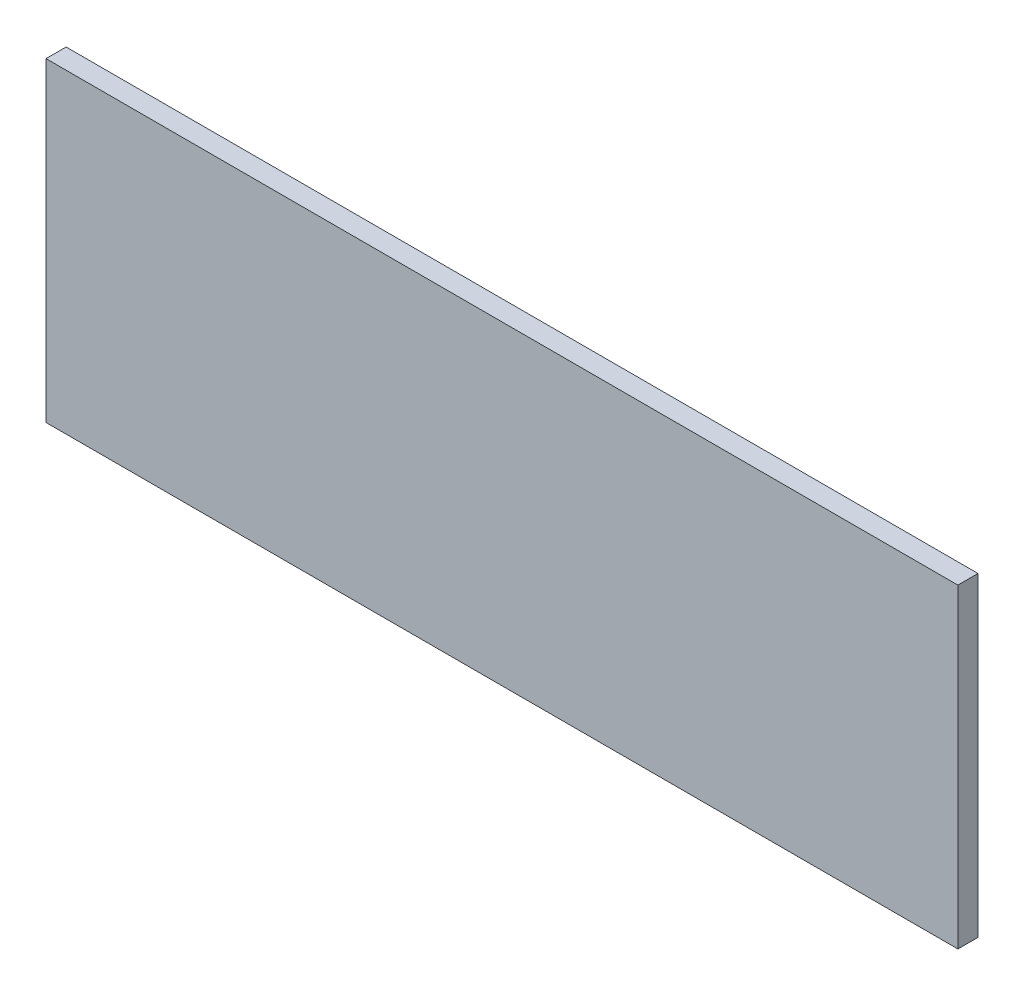
ISO-10303-21;
HEADER;
FILE_DESCRIPTION(('STEP AP214'),'2;1');
FILE_NAME('part.step','',(''),(''),'','','');
FILE_SCHEMA(('AUTOMOTIVE_DESIGN { 1 0 10303 214 1 1 1 1 }'));
ENDSEC;
DATA;
#1=APPLICATION_CONTEXT('core data for automotive mechanical design processes');
#2=APPLICATION_PROTOCOL_DEFINITION('international standard','automotive_design',2000,#1);
#3=PRODUCT_CONTEXT('',#1,'mechanical');
#4=PRODUCT('Part','Part','',(#3));
#5=PRODUCT_RELATED_PRODUCT_CATEGORY('part','',(#4));
#6=PRODUCT_DEFINITION_FORMATION('','',#4);
#7=PRODUCT_DEFINITION_CONTEXT('part definition',#1,'design');
#8=PRODUCT_DEFINITION('design','',#6,#7);
#9=PRODUCT_DEFINITION_SHAPE('','',#8);
#10=(LENGTH_UNIT() NAMED_UNIT(*) SI_UNIT(.MILLI.,.METRE.));
#11=(NAMED_UNIT(*) PLANE_ANGLE_UNIT() SI_UNIT($,.RADIAN.));
#12=(NAMED_UNIT(*) SI_UNIT($,.STERADIAN.) SOLID_ANGLE_UNIT());
#13=UNCERTAINTY_MEASURE_WITH_UNIT(LENGTH_MEASURE(1.E-05),#10,'distance_accuracy_value','');
#14=(GEOMETRIC_REPRESENTATION_CONTEXT(3) GLOBAL_UNCERTAINTY_ASSIGNED_CONTEXT((#13)) GLOBAL_UNIT_ASSIGNED_CONTEXT((#10,
#11,#12)) REPRESENTATION_CONTEXT('',''));
#15=CARTESIAN_POINT('',(0.,0.,0.));
#16=DIRECTION('',(0.,0.,1.));
#17=DIRECTION('',(1.,0.,0.));
#18=AXIS2_PLACEMENT_3D('',#15,#16,#17);
#19=CARTESIAN_POINT('',(52.6371308016878,-0.0100000000000031,-44.8481012658228));
#20=DIRECTION('',(1.,0.,0.));
#21=DIRECTION('',(0.,0.,-1.));
#22=AXIS2_PLACEMENT_3D('',#19,#20,#21);
#23=PLANE('',#22);
#24=DIRECTION('',(0.,1.,0.));
#25=VECTOR('',#24,1.);
#26=CARTESIAN_POINT('',(52.6371308016878,-0.0100000000000031,-44.8481012658228));
#27=LINE('',#26,#25);
#28=CARTESIAN_POINT('',(52.6371308016878,0.,-44.8481012658228));
#29=VERTEX_POINT('',#28);
#30=CARTESIAN_POINT('',(52.6371308016878,47.,-44.8481012658228));
#31=VERTEX_POINT('',#30);
#32=EDGE_CURVE('E49',#29,#31,#27,.T.);
#33=ORIENTED_EDGE('',*,*,#32,.F.);
#34=DIRECTION('',(0.,0.,-1.));
#35=VECTOR('',#34,1.);
#36=CARTESIAN_POINT('',(52.6371308016878,0.,0.));
#37=LINE('',#36,#35);
#38=CARTESIAN_POINT('',(52.6371308016878,0.,-47.8481012658228));
#39=VERTEX_POINT('',#38);
#40=EDGE_CURVE('E88',#29,#39,#37,.T.);
#41=ORIENTED_EDGE('',*,*,#40,.T.);
#42=DIRECTION('',(0.,1.,0.));
#43=VECTOR('',#42,1.);
#44=CARTESIAN_POINT('',(52.6371308016878,-0.0100000000000031,-47.8481012658228));
#45=LINE('',#44,#43);
#46=CARTESIAN_POINT('',(52.6371308016878,47.,-47.8481012658228));
#47=VERTEX_POINT('',#46);
#48=EDGE_CURVE('E74',#39,#47,#45,.T.);
#49=ORIENTED_EDGE('',*,*,#48,.T.);
#50=DIRECTION('',(0.,0.,-1.));
#51=VECTOR('',#50,1.);
#52=CARTESIAN_POINT('',(52.6371308016878,47.,0.));
#53=LINE('',#52,#51);
#54=EDGE_CURVE('E81',#31,#47,#53,.T.);
#55=ORIENTED_EDGE('',*,*,#54,.F.);
#56=EDGE_LOOP('',(#33,#41,#49,#55));
#57=FACE_BOUND('',#56,.T.);
#58=ADVANCED_FACE('F32',(#57),#23,.T.);
#59=CARTESIAN_POINT('',(-83.3544303797469,-0.0100000000000031,-44.8481012658228));
#60=DIRECTION('',(-1.,0.,0.));
#61=DIRECTION('',(0.,0.,1.));
#62=AXIS2_PLACEMENT_3D('',#59,#60,#61);
#63=PLANE('',#62);
#64=DIRECTION('',(0.,-1.,0.));
#65=VECTOR('',#64,1.);
#66=CARTESIAN_POINT('',(-83.3544303797469,50.,-47.8481012658228));
#67=LINE('',#66,#65);
#68=CARTESIAN_POINT('',(-83.3544303797469,47.,-47.8481012658228));
#69=VERTEX_POINT('',#68);
#70=CARTESIAN_POINT('',(-83.3544303797469,0.,-47.8481012658228));
#71=VERTEX_POINT('',#70);
#72=EDGE_CURVE('E82',#69,#71,#67,.T.);
#73=ORIENTED_EDGE('',*,*,#72,.T.);
#74=DIRECTION('',(0.,0.,1.));
#75=VECTOR('',#74,1.);
#76=CARTESIAN_POINT('',(-83.3544303797469,0.,0.));
#77=LINE('',#76,#75);
#78=CARTESIAN_POINT('',(-83.3544303797469,0.,-44.8481012658228));
#79=VERTEX_POINT('',#78);
#80=EDGE_CURVE('E90',#71,#79,#77,.T.);
#81=ORIENTED_EDGE('',*,*,#80,.T.);
#82=DIRECTION('',(0.,1.,0.));
#83=VECTOR('',#82,1.);
#84=CARTESIAN_POINT('',(-83.3544303797469,-0.0100000000000031,-44.8481012658228));
#85=LINE('',#84,#83);
#86=CARTESIAN_POINT('',(-83.3544303797469,47.,-44.8481012658228));
#87=VERTEX_POINT('',#86);
#88=EDGE_CURVE('E36',#79,#87,#85,.T.);
#89=ORIENTED_EDGE('',*,*,#88,.T.);
#90=DIRECTION('',(0.,0.,1.));
#91=VECTOR('',#90,1.);
#92=CARTESIAN_POINT('',(-83.3544303797469,47.,0.));
#93=LINE('',#92,#91);
#94=EDGE_CURVE('E98',#69,#87,#93,.T.);
#95=ORIENTED_EDGE('',*,*,#94,.F.);
#96=EDGE_LOOP('',(#73,#81,#89,#95));
#97=FACE_BOUND('',#96,.T.);
#98=ADVANCED_FACE('F103',(#97),#63,.T.);
#99=CARTESIAN_POINT('',(-98.3544303797468,47.,-44.8481012658228));
#100=DIRECTION('',(0.,0.,1.));
#101=DIRECTION('',(1.,0.,0.));
#102=AXIS2_PLACEMENT_3D('',#99,#100,#101);
#103=PLANE('',#102);
#104=ORIENTED_EDGE('',*,*,#88,.F.);
#105=DIRECTION('',(1.,0.,0.));
#106=VECTOR('',#105,1.);
#107=CARTESIAN_POINT('',(0.,0.,-44.8481012658228));
#108=LINE('',#107,#106);
#109=EDGE_CURVE('E93',#79,#29,#108,.T.);
#110=ORIENTED_EDGE('',*,*,#109,.T.);
#111=ORIENTED_EDGE('',*,*,#32,.T.);
#112=DIRECTION('',(-1.,0.,0.));
#113=VECTOR('',#112,1.);
#114=CARTESIAN_POINT('',(-98.3544303797468,47.,-44.8481012658228));
#115=LINE('',#114,#113);
#116=EDGE_CURVE('E41',#31,#87,#115,.T.);
#117=ORIENTED_EDGE('',*,*,#116,.T.);
#118=EDGE_LOOP('',(#104,#110,#111,#117));
#119=FACE_BOUND('',#118,.T.);
#120=ADVANCED_FACE('F104',(#119),#103,.T.);
#121=CARTESIAN_POINT('',(0.,47.,0.));
#122=DIRECTION('',(0.,1.,0.));
#123=DIRECTION('',(0.,0.,1.));
#124=AXIS2_PLACEMENT_3D('',#121,#122,#123);
#125=PLANE('',#124);
#126=ORIENTED_EDGE('',*,*,#116,.F.);
#127=ORIENTED_EDGE('',*,*,#54,.T.);
#128=DIRECTION('',(-1.,0.,0.));
#129=VECTOR('',#128,1.);
#130=CARTESIAN_POINT('',(-98.3544303797468,47.,-47.8481012658228));
#131=LINE('',#130,#129);
#132=EDGE_CURVE('E11',#47,#69,#131,.T.);
#133=ORIENTED_EDGE('',*,*,#132,.T.);
#134=ORIENTED_EDGE('',*,*,#94,.T.);
#135=EDGE_LOOP('',(#126,#127,#133,#134));
#136=FACE_BOUND('',#135,.T.);
#137=ADVANCED_FACE('F106',(#136),#125,.T.);
#138=CARTESIAN_POINT('',(-98.3544303797468,50.,-47.8481012658228));
#139=DIRECTION('',(0.,0.,1.));
#140=DIRECTION('',(1.,0.,0.));
#141=AXIS2_PLACEMENT_3D('',#138,#139,#140);
#142=PLANE('',#141);
#143=ORIENTED_EDGE('',*,*,#48,.F.);
#144=DIRECTION('',(-1.,0.,0.));
#145=VECTOR('',#144,1.);
#146=CARTESIAN_POINT('',(-98.3544303797468,0.,-47.8481012658228));
#147=LINE('',#146,#145);
#148=EDGE_CURVE('E77',#39,#71,#147,.T.);
#149=ORIENTED_EDGE('',*,*,#148,.T.);
#150=ORIENTED_EDGE('',*,*,#72,.F.);
#151=ORIENTED_EDGE('',*,*,#132,.F.);
#152=EDGE_LOOP('',(#143,#149,#150,#151));
#153=FACE_BOUND('',#152,.T.);
#154=ADVANCED_FACE('F34',(#153),#142,.F.);
#155=CARTESIAN_POINT('',(0.,0.,0.));
#156=DIRECTION('',(0.,1.,0.));
#157=DIRECTION('',(0.,0.,1.));
#158=AXIS2_PLACEMENT_3D('',#155,#156,#157);
#159=PLANE('',#158);
#160=ORIENTED_EDGE('',*,*,#40,.F.);
#161=ORIENTED_EDGE('',*,*,#109,.F.);
#162=ORIENTED_EDGE('',*,*,#80,.F.);
#163=ORIENTED_EDGE('',*,*,#148,.F.);
#164=EDGE_LOOP('',(#160,#161,#162,#163));
#165=FACE_BOUND('',#164,.T.);
#166=ADVANCED_FACE('F86',(#165),#159,.F.);
#167=CLOSED_SHELL('',(#58,#98,#120,#137,#154,#166));
#168=MANIFOLD_SOLID_BREP('B2',#167);
#169=ADVANCED_BREP_SHAPE_REPRESENTATION('',(#18,#168),#14);
#170=SHAPE_DEFINITION_REPRESENTATION(#9,#169);
ENDSEC;
END-ISO-10303-21;
